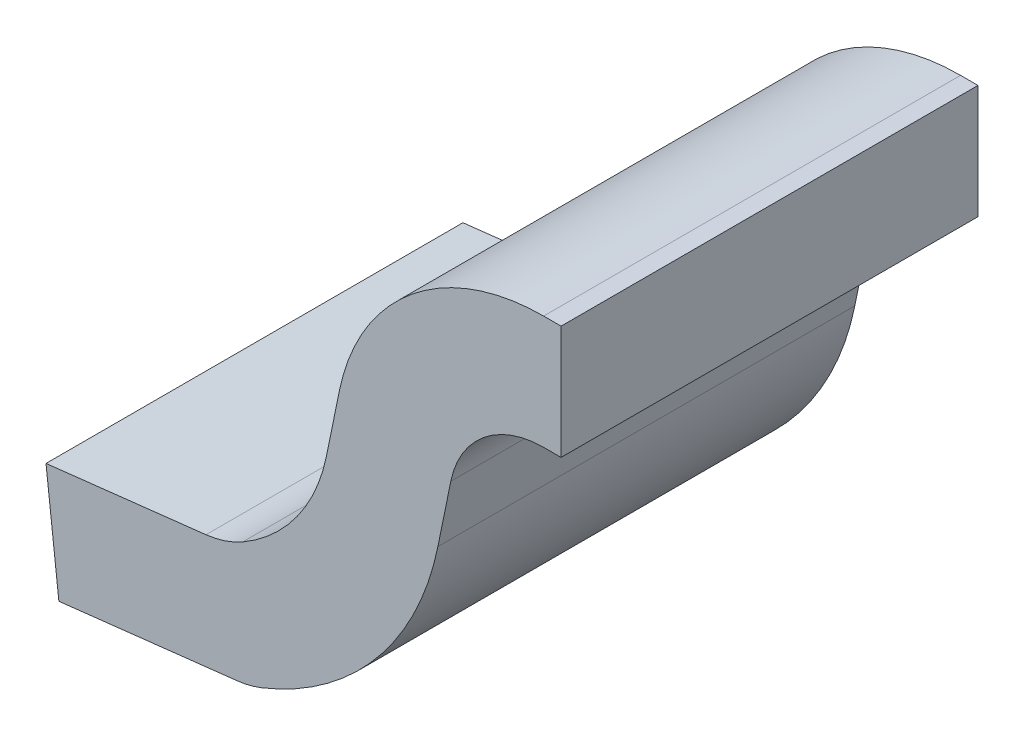
ISO-10303-21;
HEADER;
FILE_DESCRIPTION(('STEP AP214'),'2;1');
FILE_NAME('part.step','',(''),(''),'','','');
FILE_SCHEMA(('AUTOMOTIVE_DESIGN { 1 0 10303 214 1 1 1 1 }'));
ENDSEC;
DATA;
#1=APPLICATION_CONTEXT('core data for automotive mechanical design processes');
#2=APPLICATION_PROTOCOL_DEFINITION('international standard','automotive_design',2000,#1);
#3=PRODUCT_CONTEXT('',#1,'mechanical');
#4=PRODUCT('Part','Part','',(#3));
#5=PRODUCT_RELATED_PRODUCT_CATEGORY('part','',(#4));
#6=PRODUCT_DEFINITION_FORMATION('','',#4);
#7=PRODUCT_DEFINITION_CONTEXT('part definition',#1,'design');
#8=PRODUCT_DEFINITION('design','',#6,#7);
#9=PRODUCT_DEFINITION_SHAPE('','',#8);
#10=(LENGTH_UNIT() NAMED_UNIT(*) SI_UNIT(.MILLI.,.METRE.));
#11=(NAMED_UNIT(*) PLANE_ANGLE_UNIT() SI_UNIT($,.RADIAN.));
#12=(NAMED_UNIT(*) SI_UNIT($,.STERADIAN.) SOLID_ANGLE_UNIT());
#13=UNCERTAINTY_MEASURE_WITH_UNIT(LENGTH_MEASURE(1.E-05),#10,'distance_accuracy_value','');
#14=(GEOMETRIC_REPRESENTATION_CONTEXT(3) GLOBAL_UNCERTAINTY_ASSIGNED_CONTEXT((#13)) GLOBAL_UNIT_ASSIGNED_CONTEXT((#10,
#11,#12)) REPRESENTATION_CONTEXT('',''));
#15=CARTESIAN_POINT('',(0.,0.,0.));
#16=DIRECTION('',(0.,0.,1.));
#17=DIRECTION('',(1.,0.,0.));
#18=AXIS2_PLACEMENT_3D('',#15,#16,#17);
#19=CARTESIAN_POINT('',(-1.0784798395513,0.311122151443951,3.64984430510635));
#20=DIRECTION('',(0.,0.,-1.));
#21=DIRECTION('',(-1.,0.,0.));
#22=AXIS2_PLACEMENT_3D('',#19,#20,#21);
#23=CYLINDRICAL_SURFACE('',#22,0.304673812487565);
#24=CARTESIAN_POINT('',(-1.0784798395513,0.311122151443951,2.18));
#25=DIRECTION('',(0.,0.,1.));
#26=DIRECTION('',(-1.,0.,0.));
#27=AXIS2_PLACEMENT_3D('',#24,#25,#26);
#28=CIRCLE('',#27,0.304673812487565);
#29=CARTESIAN_POINT('',(-0.966363747755729,0.027827050928262,2.18));
#30=VERTEX_POINT('',#29);
#31=CARTESIAN_POINT('',(-0.78,0.25,2.18));
#32=VERTEX_POINT('',#31);
#33=EDGE_CURVE('E11',#30,#32,#28,.T.);
#34=ORIENTED_EDGE('',*,*,#33,.T.);
#35=DIRECTION('',(0.,0.,1.));
#36=VECTOR('',#35,1.);
#37=CARTESIAN_POINT('',(-0.78,0.25,3.64984430510635));
#38=LINE('',#37,#36);
#39=CARTESIAN_POINT('',(-0.78,0.25,2.62));
#40=VERTEX_POINT('',#39);
#41=EDGE_CURVE('E26',#32,#40,#38,.T.);
#42=ORIENTED_EDGE('',*,*,#41,.T.);
#43=CARTESIAN_POINT('',(-1.0784798395513,0.311122151443951,2.62));
#44=DIRECTION('',(0.,0.,-1.));
#45=DIRECTION('',(-1.,0.,0.));
#46=AXIS2_PLACEMENT_3D('',#43,#44,#45);
#47=CIRCLE('',#46,0.304673812487565);
#48=CARTESIAN_POINT('',(-0.966363747755729,0.027827050928262,2.62));
#49=VERTEX_POINT('',#48);
#50=EDGE_CURVE('E246',#40,#49,#47,.T.);
#51=ORIENTED_EDGE('',*,*,#50,.T.);
#52=DIRECTION('',(0.,0.,-1.));
#53=VECTOR('',#52,1.);
#54=CARTESIAN_POINT('',(-0.966363747755728,0.0278270509282621,3.64984430510635));
#55=LINE('',#54,#53);
#56=EDGE_CURVE('E243',#49,#30,#55,.T.);
#57=ORIENTED_EDGE('',*,*,#56,.T.);
#58=EDGE_LOOP('',(#34,#42,#51,#57));
#59=FACE_BOUND('',#58,.T.);
#60=ADVANCED_FACE('F16',(#59),#23,.T.);
#61=CARTESIAN_POINT('',(-0.766369657725016,0.316561504776176,3.64984430510635));
#62=DIRECTION('',(-0.979670149903295,0.200615047761767,0.));
#63=DIRECTION('',(0.143305470647058,0.699808381659803,0.699808381659803));
#64=AXIS2_PLACEMENT_3D('',#61,#62,#63);
#65=PLANE('',#64);
#66=ORIENTED_EDGE('',*,*,#41,.F.);
#67=DIRECTION('',(-0.200615047761767,-0.979670149903295,0.));
#68=VECTOR('',#67,1.);
#69=CARTESIAN_POINT('',(-0.766369657725016,0.316561504776176,2.18));
#70=LINE('',#69,#68);
#71=CARTESIAN_POINT('',(-0.766369657725015,0.316561504776176,2.18));
#72=VERTEX_POINT('',#71);
#73=EDGE_CURVE('E183',#72,#32,#70,.T.);
#74=ORIENTED_EDGE('',*,*,#73,.F.);
#75=DIRECTION('',(0.,0.,-1.));
#76=VECTOR('',#75,1.);
#77=CARTESIAN_POINT('',(-0.766369657725016,0.316561504776176,3.64984430510635));
#78=LINE('',#77,#76);
#79=CARTESIAN_POINT('',(-0.766369657725015,0.316561504776176,2.62));
#80=VERTEX_POINT('',#79);
#81=EDGE_CURVE('E218',#80,#72,#78,.T.);
#82=ORIENTED_EDGE('',*,*,#81,.F.);
#83=DIRECTION('',(0.200615047761767,0.979670149903295,0.));
#84=VECTOR('',#83,1.);
#85=CARTESIAN_POINT('',(-0.766369657725016,0.316561504776176,2.62));
#86=LINE('',#85,#84);
#87=EDGE_CURVE('E128',#40,#80,#86,.T.);
#88=ORIENTED_EDGE('',*,*,#87,.F.);
#89=EDGE_LOOP('',(#66,#74,#82,#88));
#90=FACE_BOUND('',#89,.T.);
#91=ADVANCED_FACE('F251',(#90),#65,.F.);
#92=CARTESIAN_POINT('',(-2.74150408033977,0.,2.18));
#93=DIRECTION('',(0.,0.,-1.));
#94=DIRECTION('',(0.707106781186548,0.707106781186548,0.));
#95=AXIS2_PLACEMENT_3D('',#92,#93,#94);
#96=PLANE('',#95);
#97=DIRECTION('',(0.200615047761764,0.979670149903295,0.));
#98=VECTOR('',#97,1.);
#99=CARTESIAN_POINT('',(-0.897560417988396,0.274073805731411,2.18));
#100=LINE('',#99,#98);
#101=CARTESIAN_POINT('',(-0.897560417988396,0.274073805731411,2.18));
#102=VERTEX_POINT('',#101);
#103=CARTESIAN_POINT('',(-0.883930075713411,0.340635310507587,2.18));
#104=VERTEX_POINT('',#103);
#105=EDGE_CURVE('E175',#102,#104,#100,.T.);
#106=ORIENTED_EDGE('',*,*,#105,.T.);
#107=CARTESIAN_POINT('',(-0.668402642734686,0.2965,2.18));
#108=DIRECTION('',(0.,0.,-1.));
#109=DIRECTION('',(-1.,0.,0.));
#110=AXIS2_PLACEMENT_3D('',#107,#108,#109);
#111=CIRCLE('',#110,0.22);
#112=CARTESIAN_POINT('',(-0.668402642734686,0.5165,2.18));
#113=VERTEX_POINT('',#112);
#114=EDGE_CURVE('E172',#104,#113,#111,.T.);
#115=ORIENTED_EDGE('',*,*,#114,.T.);
#116=DIRECTION('',(1.,0.,0.));
#117=VECTOR('',#116,1.);
#118=CARTESIAN_POINT('',(-2.74150408033977,0.5165,2.18));
#119=LINE('',#118,#117);
#120=CARTESIAN_POINT('',(-0.65,0.5165,2.18));
#121=VERTEX_POINT('',#120);
#122=EDGE_CURVE('E157',#113,#121,#119,.T.);
#123=ORIENTED_EDGE('',*,*,#122,.T.);
#124=DIRECTION('',(0.,-1.,0.));
#125=VECTOR('',#124,1.);
#126=CARTESIAN_POINT('',(-0.65,0.,2.18));
#127=LINE('',#126,#125);
#128=CARTESIAN_POINT('',(-0.65,0.3965,2.18));
#129=VERTEX_POINT('',#128);
#130=EDGE_CURVE('E165',#121,#129,#127,.T.);
#131=ORIENTED_EDGE('',*,*,#130,.T.);
#132=DIRECTION('',(-1.,0.,0.));
#133=VECTOR('',#132,1.);
#134=CARTESIAN_POINT('',(-2.74150408033977,0.3965,2.18));
#135=LINE('',#134,#133);
#136=CARTESIAN_POINT('',(-0.668402642734686,0.3965,2.18));
#137=VERTEX_POINT('',#136);
#138=EDGE_CURVE('E168',#129,#137,#135,.T.);
#139=ORIENTED_EDGE('',*,*,#138,.T.);
#140=CARTESIAN_POINT('',(-0.668402642734686,0.2965,2.18));
#141=DIRECTION('',(0.,0.,1.));
#142=DIRECTION('',(-1.,0.,0.));
#143=AXIS2_PLACEMENT_3D('',#140,#141,#142);
#144=CIRCLE('',#143,0.1);
#145=EDGE_CURVE('E180',#137,#72,#144,.T.);
#146=ORIENTED_EDGE('',*,*,#145,.T.);
#147=ORIENTED_EDGE('',*,*,#73,.T.);
#148=ORIENTED_EDGE('',*,*,#33,.F.);
#149=CARTESIAN_POINT('',(-1.00316247715101,0.120810132802833,2.18));
#150=DIRECTION('',(0.,0.,-1.));
#151=DIRECTION('',(-1.,0.,0.));
#152=AXIS2_PLACEMENT_3D('',#149,#150,#151);
#153=CIRCLE('',#152,0.1);
#154=CARTESIAN_POINT('',(-0.991834300901524,0.0214538424993968,2.18));
#155=VERTEX_POINT('',#154);
#156=EDGE_CURVE('E184',#30,#155,#153,.T.);
#157=ORIENTED_EDGE('',*,*,#156,.T.);
#158=DIRECTION('',(-0.993562903034362,-0.113281762494813,0.));
#159=VECTOR('',#158,1.);
#160=CARTESIAN_POINT('',(-0.991834300901524,0.0214538424993968,2.18));
#161=LINE('',#160,#159);
#162=CARTESIAN_POINT('',(-1.18,0.,2.18));
#163=VERTEX_POINT('',#162);
#164=EDGE_CURVE('E187',#155,#163,#161,.T.);
#165=ORIENTED_EDGE('',*,*,#164,.T.);
#166=DIRECTION('',(-0.113281762494811,0.993562903034362,0.));
#167=VECTOR('',#166,1.);
#168=CARTESIAN_POINT('',(-1.18,0.,2.18));
#169=LINE('',#168,#167);
#170=CARTESIAN_POINT('',(-1.19359381149938,0.119227548364122,2.18));
#171=VERTEX_POINT('',#170);
#172=EDGE_CURVE('E138',#163,#171,#169,.T.);
#173=ORIENTED_EDGE('',*,*,#172,.T.);
#174=DIRECTION('',(0.993562903034362,0.113281762494813,0.));
#175=VECTOR('',#174,1.);
#176=CARTESIAN_POINT('',(-1.19359381149938,0.119227548364122,2.18));
#177=LINE('',#176,#175);
#178=CARTESIAN_POINT('',(-1.02473971532561,0.13847956508155,2.18));
#179=VERTEX_POINT('',#178);
#180=EDGE_CURVE('E190',#171,#179,#177,.T.);
#181=ORIENTED_EDGE('',*,*,#180,.T.);
#182=CARTESIAN_POINT('',(-1.03606789157509,0.237835855384986,2.18));
#183=DIRECTION('',(0.,0.,1.));
#184=DIRECTION('',(-1.,0.,0.));
#185=AXIS2_PLACEMENT_3D('',#182,#183,#184);
#186=CIRCLE('',#185,0.1);
#187=CARTESIAN_POINT('',(-0.985979267087511,0.151284542876496,2.18));
#188=VERTEX_POINT('',#187);
#189=EDGE_CURVE('E193',#179,#188,#186,.T.);
#190=ORIENTED_EDGE('',*,*,#189,.T.);
#191=CARTESIAN_POINT('',(-1.0784798395513,0.311122151443951,2.18));
#192=DIRECTION('',(0.,0.,1.));
#193=DIRECTION('',(-1.,0.,0.));
#194=AXIS2_PLACEMENT_3D('',#191,#192,#193);
#195=CIRCLE('',#194,0.184673812487564);
#196=EDGE_CURVE('E196',#188,#102,#195,.T.);
#197=ORIENTED_EDGE('',*,*,#196,.T.);
#198=EDGE_LOOP('',(#106,#115,#123,#131,#139,#146,#147,#148,#157,#165,#173,#181,#190,#197));
#199=FACE_BOUND('',#198,.T.);
#200=ADVANCED_FACE('F171',(#199),#96,.T.);
#201=CARTESIAN_POINT('',(-1.00316247715101,0.120810132802833,3.64984430510635));
#202=DIRECTION('',(0.,0.,-1.));
#203=DIRECTION('',(-1.,0.,0.));
#204=AXIS2_PLACEMENT_3D('',#201,#202,#203);
#205=CYLINDRICAL_SURFACE('',#204,0.1);
#206=ORIENTED_EDGE('',*,*,#156,.F.);
#207=ORIENTED_EDGE('',*,*,#56,.F.);
#208=CARTESIAN_POINT('',(-1.00316247715101,0.120810132802833,2.62));
#209=DIRECTION('',(0.,0.,-1.));
#210=DIRECTION('',(-1.,0.,0.));
#211=AXIS2_PLACEMENT_3D('',#208,#209,#210);
#212=CIRCLE('',#211,0.1);
#213=CARTESIAN_POINT('',(-0.991834300901524,0.0214538424993968,2.62));
#214=VERTEX_POINT('',#213);
#215=EDGE_CURVE('E198',#49,#214,#212,.T.);
#216=ORIENTED_EDGE('',*,*,#215,.T.);
#217=DIRECTION('',(0.,0.,-1.));
#218=VECTOR('',#217,1.);
#219=CARTESIAN_POINT('',(-0.991834300901524,0.0214538424993968,3.64984430510635));
#220=LINE('',#219,#218);
#221=EDGE_CURVE('E124',#214,#155,#220,.T.);
#222=ORIENTED_EDGE('',*,*,#221,.T.);
#223=EDGE_LOOP('',(#206,#207,#216,#222));
#224=FACE_BOUND('',#223,.T.);
#225=ADVANCED_FACE('F241',(#224),#205,.T.);
#226=CARTESIAN_POINT('',(-2.74150408033977,0.,2.62));
#227=DIRECTION('',(0.,0.,1.));
#228=DIRECTION('',(0.707106781186548,0.707106781186548,0.));
#229=AXIS2_PLACEMENT_3D('',#226,#227,#228);
#230=PLANE('',#229);
#231=DIRECTION('',(1.,0.,0.));
#232=VECTOR('',#231,1.);
#233=CARTESIAN_POINT('',(-2.74150408033977,0.3965,2.62));
#234=LINE('',#233,#232);
#235=CARTESIAN_POINT('',(-0.668402642734686,0.3965,2.62));
#236=VERTEX_POINT('',#235);
#237=CARTESIAN_POINT('',(-0.65,0.3965,2.62));
#238=VERTEX_POINT('',#237);
#239=EDGE_CURVE('E201',#236,#238,#234,.T.);
#240=ORIENTED_EDGE('',*,*,#239,.T.);
#241=DIRECTION('',(0.,1.,0.));
#242=VECTOR('',#241,1.);
#243=CARTESIAN_POINT('',(-0.65,0.,2.62));
#244=LINE('',#243,#242);
#245=CARTESIAN_POINT('',(-0.65,0.5165,2.62));
#246=VERTEX_POINT('',#245);
#247=EDGE_CURVE('E163',#238,#246,#244,.T.);
#248=ORIENTED_EDGE('',*,*,#247,.T.);
#249=DIRECTION('',(-1.,0.,0.));
#250=VECTOR('',#249,1.);
#251=CARTESIAN_POINT('',(-2.74150408033977,0.5165,2.62));
#252=LINE('',#251,#250);
#253=CARTESIAN_POINT('',(-0.668402642734686,0.5165,2.62));
#254=VERTEX_POINT('',#253);
#255=EDGE_CURVE('E160',#246,#254,#252,.T.);
#256=ORIENTED_EDGE('',*,*,#255,.T.);
#257=CARTESIAN_POINT('',(-0.668402642734686,0.2965,2.62));
#258=DIRECTION('',(0.,0.,1.));
#259=DIRECTION('',(-1.,0.,0.));
#260=AXIS2_PLACEMENT_3D('',#257,#258,#259);
#261=CIRCLE('',#260,0.22);
#262=CARTESIAN_POINT('',(-0.883930075713411,0.340635310507587,2.62));
#263=VERTEX_POINT('',#262);
#264=EDGE_CURVE('E205',#254,#263,#261,.T.);
#265=ORIENTED_EDGE('',*,*,#264,.T.);
#266=DIRECTION('',(-0.200615047761764,-0.979670149903295,0.));
#267=VECTOR('',#266,1.);
#268=CARTESIAN_POINT('',(-0.883930075713411,0.340635310507586,2.62));
#269=LINE('',#268,#267);
#270=CARTESIAN_POINT('',(-0.897560417988396,0.274073805731411,2.62));
#271=VERTEX_POINT('',#270);
#272=EDGE_CURVE('E208',#263,#271,#269,.T.);
#273=ORIENTED_EDGE('',*,*,#272,.T.);
#274=CARTESIAN_POINT('',(-1.0784798395513,0.311122151443951,2.62));
#275=DIRECTION('',(0.,0.,-1.));
#276=DIRECTION('',(-1.,0.,0.));
#277=AXIS2_PLACEMENT_3D('',#274,#275,#276);
#278=CIRCLE('',#277,0.184673812487564);
#279=CARTESIAN_POINT('',(-0.985979267087511,0.151284542876496,2.62));
#280=VERTEX_POINT('',#279);
#281=EDGE_CURVE('E211',#271,#280,#278,.T.);
#282=ORIENTED_EDGE('',*,*,#281,.T.);
#283=CARTESIAN_POINT('',(-1.03606789157509,0.237835855384986,2.62));
#284=DIRECTION('',(0.,0.,-1.));
#285=DIRECTION('',(-1.,0.,0.));
#286=AXIS2_PLACEMENT_3D('',#283,#284,#285);
#287=CIRCLE('',#286,0.1);
#288=CARTESIAN_POINT('',(-1.02473971532561,0.13847956508155,2.62));
#289=VERTEX_POINT('',#288);
#290=EDGE_CURVE('E214',#280,#289,#287,.T.);
#291=ORIENTED_EDGE('',*,*,#290,.T.);
#292=DIRECTION('',(-0.993562903034362,-0.113281762494813,0.));
#293=VECTOR('',#292,1.);
#294=CARTESIAN_POINT('',(-1.02473971532561,0.13847956508155,2.62));
#295=LINE('',#294,#293);
#296=CARTESIAN_POINT('',(-1.19359381149938,0.119227548364122,2.62));
#297=VERTEX_POINT('',#296);
#298=EDGE_CURVE('E133',#289,#297,#295,.T.);
#299=ORIENTED_EDGE('',*,*,#298,.T.);
#300=DIRECTION('',(0.113281762494811,-0.993562903034362,0.));
#301=VECTOR('',#300,1.);
#302=CARTESIAN_POINT('',(-1.19359381149938,0.119227548364122,2.62));
#303=LINE('',#302,#301);
#304=CARTESIAN_POINT('',(-1.18,0.,2.62));
#305=VERTEX_POINT('',#304);
#306=EDGE_CURVE('E114',#297,#305,#303,.T.);
#307=ORIENTED_EDGE('',*,*,#306,.T.);
#308=DIRECTION('',(0.993562903034362,0.113281762494813,0.));
#309=VECTOR('',#308,1.);
#310=CARTESIAN_POINT('',(-1.18,0.,2.62));
#311=LINE('',#310,#309);
#312=EDGE_CURVE('E120',#305,#214,#311,.T.);
#313=ORIENTED_EDGE('',*,*,#312,.T.);
#314=ORIENTED_EDGE('',*,*,#215,.F.);
#315=ORIENTED_EDGE('',*,*,#50,.F.);
#316=ORIENTED_EDGE('',*,*,#87,.T.);
#317=CARTESIAN_POINT('',(-0.668402642734686,0.2965,2.62));
#318=DIRECTION('',(0.,0.,-1.));
#319=DIRECTION('',(-1.,0.,0.));
#320=AXIS2_PLACEMENT_3D('',#317,#318,#319);
#321=CIRCLE('',#320,0.1);
#322=EDGE_CURVE('E217',#80,#236,#321,.T.);
#323=ORIENTED_EDGE('',*,*,#322,.T.);
#324=EDGE_LOOP('',(#240,#248,#256,#265,#273,#282,#291,#299,#307,#313,#314,#315,#316,#323));
#325=FACE_BOUND('',#324,.T.);
#326=ADVANCED_FACE('F131',(#325),#230,.T.);
#327=CARTESIAN_POINT('',(-0.668402642734686,0.2965,3.64984430510635));
#328=DIRECTION('',(0.,0.,-1.));
#329=DIRECTION('',(-1.,0.,0.));
#330=AXIS2_PLACEMENT_3D('',#327,#328,#329);
#331=CYLINDRICAL_SURFACE('',#330,0.1);
#332=ORIENTED_EDGE('',*,*,#81,.T.);
#333=ORIENTED_EDGE('',*,*,#145,.F.);
#334=DIRECTION('',(0.,0.,-1.));
#335=VECTOR('',#334,1.);
#336=CARTESIAN_POINT('',(-0.668402642734686,0.3965,3.64984430510635));
#337=LINE('',#336,#335);
#338=EDGE_CURVE('E141',#236,#137,#337,.T.);
#339=ORIENTED_EDGE('',*,*,#338,.F.);
#340=ORIENTED_EDGE('',*,*,#322,.F.);
#341=EDGE_LOOP('',(#332,#333,#339,#340));
#342=FACE_BOUND('',#341,.T.);
#343=ADVANCED_FACE('F260',(#342),#331,.F.);
#344=CARTESIAN_POINT('',(-0.668402642734686,0.2965,3.64984430510635));
#345=DIRECTION('',(0.,0.,-1.));
#346=DIRECTION('',(-1.,0.,0.));
#347=AXIS2_PLACEMENT_3D('',#344,#345,#346);
#348=CYLINDRICAL_SURFACE('',#347,0.22);
#349=ORIENTED_EDGE('',*,*,#114,.F.);
#350=DIRECTION('',(0.,0.,1.));
#351=VECTOR('',#350,1.);
#352=CARTESIAN_POINT('',(-0.883930075713411,0.340635310507586,3.64984430510635));
#353=LINE('',#352,#351);
#354=EDGE_CURVE('E220',#104,#263,#353,.T.);
#355=ORIENTED_EDGE('',*,*,#354,.T.);
#356=ORIENTED_EDGE('',*,*,#264,.F.);
#357=DIRECTION('',(0.,0.,-1.));
#358=VECTOR('',#357,1.);
#359=CARTESIAN_POINT('',(-0.668402642734686,0.5165,3.64984430510635));
#360=LINE('',#359,#358);
#361=EDGE_CURVE('E223',#254,#113,#360,.T.);
#362=ORIENTED_EDGE('',*,*,#361,.T.);
#363=EDGE_LOOP('',(#349,#355,#356,#362));
#364=FACE_BOUND('',#363,.T.);
#365=ADVANCED_FACE('F287',(#364),#348,.T.);
#366=CARTESIAN_POINT('',(-0.883930075713411,0.340635310507586,3.64984430510635));
#367=DIRECTION('',(0.979670149903295,-0.200615047761764,0.));
#368=DIRECTION('',(0.143305470647057,0.699808381659803,0.699808381659803));
#369=AXIS2_PLACEMENT_3D('',#366,#367,#368);
#370=PLANE('',#369);
#371=ORIENTED_EDGE('',*,*,#354,.F.);
#372=ORIENTED_EDGE('',*,*,#105,.F.);
#373=DIRECTION('',(0.,0.,-1.));
#374=VECTOR('',#373,1.);
#375=CARTESIAN_POINT('',(-0.897560417988396,0.274073805731411,3.64984430510635));
#376=LINE('',#375,#374);
#377=EDGE_CURVE('E225',#271,#102,#376,.T.);
#378=ORIENTED_EDGE('',*,*,#377,.F.);
#379=ORIENTED_EDGE('',*,*,#272,.F.);
#380=EDGE_LOOP('',(#371,#372,#378,#379));
#381=FACE_BOUND('',#380,.T.);
#382=ADVANCED_FACE('F290',(#381),#370,.F.);
#383=CARTESIAN_POINT('',(-1.0784798395513,0.311122151443951,3.64984430510635));
#384=DIRECTION('',(0.,0.,-1.));
#385=DIRECTION('',(-1.,0.,0.));
#386=AXIS2_PLACEMENT_3D('',#383,#384,#385);
#387=CYLINDRICAL_SURFACE('',#386,0.184673812487564);
#388=ORIENTED_EDGE('',*,*,#377,.T.);
#389=ORIENTED_EDGE('',*,*,#196,.F.);
#390=DIRECTION('',(0.,0.,-1.));
#391=VECTOR('',#390,1.);
#392=CARTESIAN_POINT('',(-0.985979267087511,0.151284542876496,3.64984430510635));
#393=LINE('',#392,#391);
#394=EDGE_CURVE('E228',#280,#188,#393,.T.);
#395=ORIENTED_EDGE('',*,*,#394,.F.);
#396=ORIENTED_EDGE('',*,*,#281,.F.);
#397=EDGE_LOOP('',(#388,#389,#395,#396));
#398=FACE_BOUND('',#397,.T.);
#399=ADVANCED_FACE('F294',(#398),#387,.F.);
#400=CARTESIAN_POINT('',(-1.03606789157509,0.237835855384986,3.64984430510635));
#401=DIRECTION('',(0.,0.,-1.));
#402=DIRECTION('',(-1.,0.,0.));
#403=AXIS2_PLACEMENT_3D('',#400,#401,#402);
#404=CYLINDRICAL_SURFACE('',#403,0.1);
#405=ORIENTED_EDGE('',*,*,#394,.T.);
#406=ORIENTED_EDGE('',*,*,#189,.F.);
#407=DIRECTION('',(0.,0.,-1.));
#408=VECTOR('',#407,1.);
#409=CARTESIAN_POINT('',(-1.02473971532561,0.13847956508155,3.64984430510635));
#410=LINE('',#409,#408);
#411=EDGE_CURVE('E143',#289,#179,#410,.T.);
#412=ORIENTED_EDGE('',*,*,#411,.F.);
#413=ORIENTED_EDGE('',*,*,#290,.F.);
#414=EDGE_LOOP('',(#405,#406,#412,#413));
#415=FACE_BOUND('',#414,.T.);
#416=ADVANCED_FACE('F235',(#415),#404,.F.);
#417=CARTESIAN_POINT('',(-1.19359381149938,0.119227548364122,3.64984430510635));
#418=DIRECTION('',(0.113281762494814,-0.993562903034362,0.));
#419=DIRECTION('',(0.704819900881673,0.0803605291315253,0.704819900881673));
#420=AXIS2_PLACEMENT_3D('',#417,#418,#419);
#421=PLANE('',#420);
#422=ORIENTED_EDGE('',*,*,#411,.T.);
#423=ORIENTED_EDGE('',*,*,#180,.F.);
#424=DIRECTION('',(0.,0.,-1.));
#425=VECTOR('',#424,1.);
#426=CARTESIAN_POINT('',(-1.19359381149938,0.119227548364122,3.64984430510635));
#427=LINE('',#426,#425);
#428=EDGE_CURVE('E140',#297,#171,#427,.T.);
#429=ORIENTED_EDGE('',*,*,#428,.F.);
#430=ORIENTED_EDGE('',*,*,#298,.F.);
#431=EDGE_LOOP('',(#422,#423,#429,#430));
#432=FACE_BOUND('',#431,.T.);
#433=ADVANCED_FACE('F233',(#432),#421,.F.);
#434=CARTESIAN_POINT('',(-1.19359381149938,0.119227548364122,3.64984430510635));
#435=DIRECTION('',(0.993562903034361,0.11328176249482,0.));
#436=DIRECTION('',(-0.0803605291315301,0.704819900881672,0.704819900881672));
#437=AXIS2_PLACEMENT_3D('',#434,#435,#436);
#438=PLANE('',#437);
#439=ORIENTED_EDGE('',*,*,#428,.T.);
#440=ORIENTED_EDGE('',*,*,#172,.F.);
#441=DIRECTION('',(0.,0.,-1.));
#442=VECTOR('',#441,1.);
#443=CARTESIAN_POINT('',(-1.18,0.,3.64984430510635));
#444=LINE('',#443,#442);
#445=EDGE_CURVE('E122',#305,#163,#444,.T.);
#446=ORIENTED_EDGE('',*,*,#445,.F.);
#447=ORIENTED_EDGE('',*,*,#306,.F.);
#448=EDGE_LOOP('',(#439,#440,#446,#447));
#449=FACE_BOUND('',#448,.T.);
#450=ADVANCED_FACE('F136',(#449),#438,.F.);
#451=CARTESIAN_POINT('',(-1.18,0.,3.64984430510635));
#452=DIRECTION('',(-0.113281762494813,0.993562903034362,0.));
#453=DIRECTION('',(0.704819900881673,0.0803605291315249,0.704819900881673));
#454=AXIS2_PLACEMENT_3D('',#451,#452,#453);
#455=PLANE('',#454);
#456=ORIENTED_EDGE('',*,*,#445,.T.);
#457=ORIENTED_EDGE('',*,*,#164,.F.);
#458=ORIENTED_EDGE('',*,*,#221,.F.);
#459=ORIENTED_EDGE('',*,*,#312,.F.);
#460=EDGE_LOOP('',(#456,#457,#458,#459));
#461=FACE_BOUND('',#460,.T.);
#462=ADVANCED_FACE('F121',(#461),#455,.F.);
#463=CARTESIAN_POINT('',(-0.65,0.3965,3.64984430510635));
#464=DIRECTION('',(0.,1.,0.));
#465=DIRECTION('',(0.707106781186548,0.,0.707106781186548));
#466=AXIS2_PLACEMENT_3D('',#463,#464,#465);
#467=PLANE('',#466);
#468=ORIENTED_EDGE('',*,*,#338,.T.);
#469=ORIENTED_EDGE('',*,*,#138,.F.);
#470=DIRECTION('',(0.,0.,-1.));
#471=VECTOR('',#470,1.);
#472=CARTESIAN_POINT('',(-0.65,0.3965,3.64984430510635));
#473=LINE('',#472,#471);
#474=EDGE_CURVE('E146',#238,#129,#473,.T.);
#475=ORIENTED_EDGE('',*,*,#474,.F.);
#476=ORIENTED_EDGE('',*,*,#239,.F.);
#477=EDGE_LOOP('',(#468,#469,#475,#476));
#478=FACE_BOUND('',#477,.T.);
#479=ADVANCED_FACE('F263',(#478),#467,.F.);
#480=CARTESIAN_POINT('',(-0.65,0.5165,3.64984430510635));
#481=DIRECTION('',(-1.,0.,0.));
#482=DIRECTION('',(0.,0.707106781186548,0.707106781186548));
#483=AXIS2_PLACEMENT_3D('',#480,#481,#482);
#484=PLANE('',#483);
#485=ORIENTED_EDGE('',*,*,#474,.T.);
#486=ORIENTED_EDGE('',*,*,#130,.F.);
#487=DIRECTION('',(0.,0.,-1.));
#488=VECTOR('',#487,1.);
#489=CARTESIAN_POINT('',(-0.65,0.5165,3.64984430510635));
#490=LINE('',#489,#488);
#491=EDGE_CURVE('E20',#246,#121,#490,.T.);
#492=ORIENTED_EDGE('',*,*,#491,.F.);
#493=ORIENTED_EDGE('',*,*,#247,.F.);
#494=EDGE_LOOP('',(#485,#486,#492,#493));
#495=FACE_BOUND('',#494,.T.);
#496=ADVANCED_FACE('F162',(#495),#484,.F.);
#497=CARTESIAN_POINT('',(-0.65,0.5165,3.64984430510635));
#498=DIRECTION('',(0.,-1.,0.));
#499=DIRECTION('',(0.707106781186548,0.,0.707106781186548));
#500=AXIS2_PLACEMENT_3D('',#497,#498,#499);
#501=PLANE('',#500);
#502=ORIENTED_EDGE('',*,*,#491,.T.);
#503=ORIENTED_EDGE('',*,*,#122,.F.);
#504=ORIENTED_EDGE('',*,*,#361,.F.);
#505=ORIENTED_EDGE('',*,*,#255,.F.);
#506=EDGE_LOOP('',(#502,#503,#504,#505));
#507=FACE_BOUND('',#506,.T.);
#508=ADVANCED_FACE('F18',(#507),#501,.F.);
#509=CLOSED_SHELL('',(#60,#91,#200,#225,#326,#343,#365,#382,#399,#416,#433,#450,#462,#479,#496,#508));
#510=MANIFOLD_SOLID_BREP('B1',#509);
#511=ADVANCED_BREP_SHAPE_REPRESENTATION('',(#18,#510),#14);
#512=SHAPE_DEFINITION_REPRESENTATION(#9,#511);
ENDSEC;
END-ISO-10303-21;
